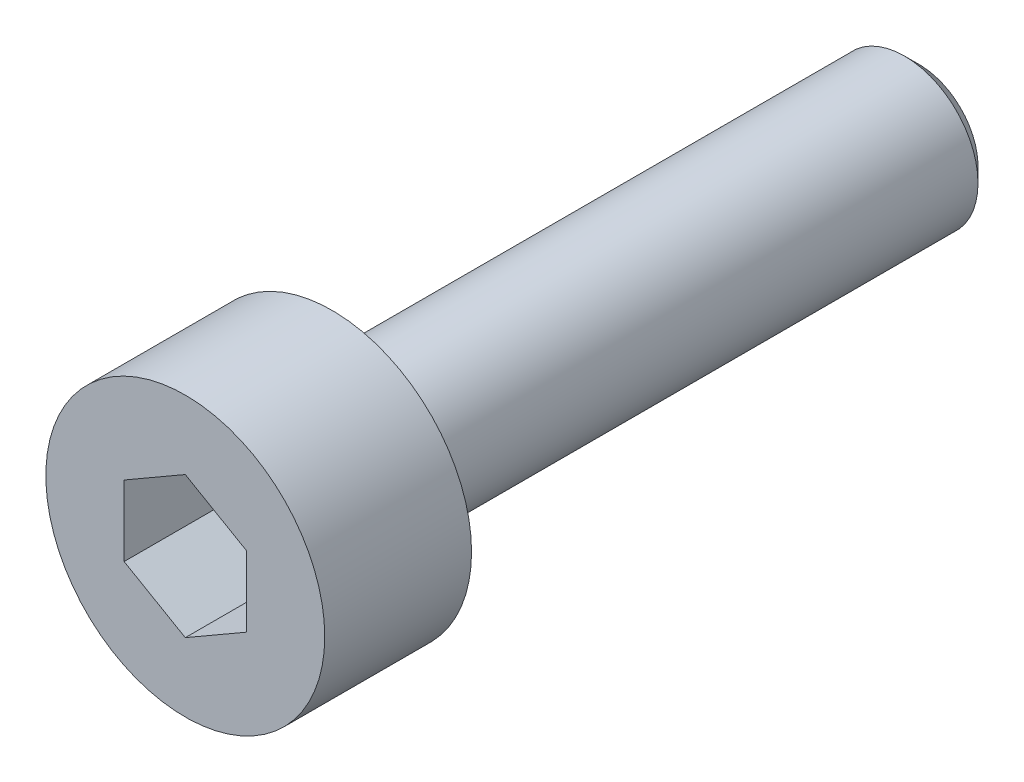
ISO-10303-21;
HEADER;
FILE_DESCRIPTION(('STEP AP214'),'2;1');
FILE_NAME('part.step','',(''),(''),'','','');
FILE_SCHEMA(('AUTOMOTIVE_DESIGN { 1 0 10303 214 1 1 1 1 }'));
ENDSEC;
DATA;
#1=APPLICATION_CONTEXT('core data for automotive mechanical design processes');
#2=APPLICATION_PROTOCOL_DEFINITION('international standard','automotive_design',2000,#1);
#3=PRODUCT_CONTEXT('',#1,'mechanical');
#4=PRODUCT('Part','Part','',(#3));
#5=PRODUCT_RELATED_PRODUCT_CATEGORY('part','',(#4));
#6=PRODUCT_DEFINITION_FORMATION('','',#4);
#7=PRODUCT_DEFINITION_CONTEXT('part definition',#1,'design');
#8=PRODUCT_DEFINITION('design','',#6,#7);
#9=PRODUCT_DEFINITION_SHAPE('','',#8);
#10=(LENGTH_UNIT() NAMED_UNIT(*) SI_UNIT(.MILLI.,.METRE.));
#11=(NAMED_UNIT(*) PLANE_ANGLE_UNIT() SI_UNIT($,.RADIAN.));
#12=(NAMED_UNIT(*) SI_UNIT($,.STERADIAN.) SOLID_ANGLE_UNIT());
#13=UNCERTAINTY_MEASURE_WITH_UNIT(LENGTH_MEASURE(1.E-05),#10,'distance_accuracy_value','');
#14=(GEOMETRIC_REPRESENTATION_CONTEXT(3) GLOBAL_UNCERTAINTY_ASSIGNED_CONTEXT((#13)) GLOBAL_UNIT_ASSIGNED_CONTEXT((#10,
#11,#12)) REPRESENTATION_CONTEXT('',''));
#15=CARTESIAN_POINT('',(0.,0.,0.));
#16=DIRECTION('',(0.,0.,1.));
#17=DIRECTION('',(1.,0.,0.));
#18=AXIS2_PLACEMENT_3D('',#15,#16,#17);
#19=CARTESIAN_POINT('',(0.,0.,0.));
#20=DIRECTION('',(0.,0.,1.));
#21=DIRECTION('',(1.,0.,0.));
#22=AXIS2_PLACEMENT_3D('',#19,#20,#21);
#23=PLANE('',#22);
#24=CARTESIAN_POINT('',(0.,0.,0.));
#25=DIRECTION('',(0.,0.,1.));
#26=DIRECTION('',(1.,0.,0.));
#27=AXIS2_PLACEMENT_3D('',#24,#25,#26);
#28=CIRCLE('',#27,2.85);
#29=CARTESIAN_POINT('',(2.85,0.,0.));
#30=VERTEX_POINT('',#29);
#31=EDGE_CURVE('E145',#30,#30,#28,.T.);
#32=ORIENTED_EDGE('',*,*,#31,.F.);
#33=EDGE_LOOP('',(#32));
#34=FACE_BOUND('',#33,.T.);
#35=CARTESIAN_POINT('',(0.,0.,0.));
#36=DIRECTION('',(0.,0.,1.));
#37=DIRECTION('',(1.,0.,0.));
#38=AXIS2_PLACEMENT_3D('',#35,#36,#37);
#39=CIRCLE('',#38,1.5);
#40=CARTESIAN_POINT('',(1.5,0.,0.));
#41=VERTEX_POINT('',#40);
#42=EDGE_CURVE('E156',#41,#41,#39,.F.);
#43=ORIENTED_EDGE('',*,*,#42,.F.);
#44=EDGE_LOOP('',(#43));
#45=FACE_BOUND('',#44,.T.);
#46=ADVANCED_FACE('F38',(#34,#45),#23,.F.);
#47=CARTESIAN_POINT('',(0.,0.,3.));
#48=DIRECTION('',(0.,0.,-1.));
#49=DIRECTION('',(-1.,0.,0.));
#50=AXIS2_PLACEMENT_3D('',#47,#48,#49);
#51=CYLINDRICAL_SURFACE('',#50,2.85);
#52=CARTESIAN_POINT('',(0.,0.,3.));
#53=DIRECTION('',(0.,0.,1.));
#54=DIRECTION('',(1.,0.,0.));
#55=AXIS2_PLACEMENT_3D('',#52,#53,#54);
#56=CIRCLE('',#55,2.85);
#57=CARTESIAN_POINT('',(2.85,0.,3.));
#58=VERTEX_POINT('',#57);
#59=EDGE_CURVE('E152',#58,#58,#56,.T.);
#60=ORIENTED_EDGE('',*,*,#59,.F.);
#61=EDGE_LOOP('',(#60));
#62=FACE_BOUND('',#61,.T.);
#63=ORIENTED_EDGE('',*,*,#31,.T.);
#64=EDGE_LOOP('',(#63));
#65=FACE_BOUND('',#64,.T.);
#66=ADVANCED_FACE('F180',(#62,#65),#51,.T.);
#67=CARTESIAN_POINT('',(0.,0.,3.));
#68=DIRECTION('',(0.,0.,1.));
#69=DIRECTION('',(1.,0.,0.));
#70=AXIS2_PLACEMENT_3D('',#67,#68,#69);
#71=PLANE('',#70);
#72=DIRECTION('',(-0.866025403784439,0.5,0.));
#73=VECTOR('',#72,1.);
#74=CARTESIAN_POINT('',(1.25,0.721687836487032,3.));
#75=LINE('',#74,#73);
#76=CARTESIAN_POINT('',(1.25,0.721687836487032,3.));
#77=VERTEX_POINT('',#76);
#78=CARTESIAN_POINT('',(0.,1.44337567297406,3.));
#79=VERTEX_POINT('',#78);
#80=EDGE_CURVE('E53',#77,#79,#75,.T.);
#81=ORIENTED_EDGE('',*,*,#80,.F.);
#82=DIRECTION('',(0.,1.,0.));
#83=VECTOR('',#82,1.);
#84=CARTESIAN_POINT('',(1.25,-0.721687836487032,3.));
#85=LINE('',#84,#83);
#86=CARTESIAN_POINT('',(1.25,-0.721687836487032,3.));
#87=VERTEX_POINT('',#86);
#88=EDGE_CURVE('E140',#87,#77,#85,.T.);
#89=ORIENTED_EDGE('',*,*,#88,.F.);
#90=DIRECTION('',(0.866025403784439,0.5,0.));
#91=VECTOR('',#90,1.);
#92=CARTESIAN_POINT('',(0.,-1.44337567297406,3.));
#93=LINE('',#92,#91);
#94=CARTESIAN_POINT('',(0.,-1.44337567297406,3.));
#95=VERTEX_POINT('',#94);
#96=EDGE_CURVE('E138',#95,#87,#93,.T.);
#97=ORIENTED_EDGE('',*,*,#96,.F.);
#98=DIRECTION('',(0.866025403784439,-0.5,0.));
#99=VECTOR('',#98,1.);
#100=CARTESIAN_POINT('',(-1.25,-0.721687836487033,3.));
#101=LINE('',#100,#99);
#102=CARTESIAN_POINT('',(-1.25,-0.721687836487033,3.));
#103=VERTEX_POINT('',#102);
#104=EDGE_CURVE('E103',#103,#95,#101,.T.);
#105=ORIENTED_EDGE('',*,*,#104,.F.);
#106=DIRECTION('',(0.,-1.,0.));
#107=VECTOR('',#106,1.);
#108=CARTESIAN_POINT('',(-1.25,0.721687836487032,3.));
#109=LINE('',#108,#107);
#110=CARTESIAN_POINT('',(-1.25,0.721687836487032,3.));
#111=VERTEX_POINT('',#110);
#112=EDGE_CURVE('E134',#111,#103,#109,.T.);
#113=ORIENTED_EDGE('',*,*,#112,.F.);
#114=DIRECTION('',(-0.866025403784439,-0.5,0.));
#115=VECTOR('',#114,1.);
#116=CARTESIAN_POINT('',(0.,1.44337567297406,3.));
#117=LINE('',#116,#115);
#118=EDGE_CURVE('E131',#79,#111,#117,.T.);
#119=ORIENTED_EDGE('',*,*,#118,.F.);
#120=EDGE_LOOP('',(#81,#89,#97,#105,#113,#119));
#121=FACE_BOUND('',#120,.T.);
#122=ORIENTED_EDGE('',*,*,#59,.T.);
#123=EDGE_LOOP('',(#122));
#124=FACE_BOUND('',#123,.T.);
#125=ADVANCED_FACE('F186',(#121,#124),#71,.T.);
#126=CARTESIAN_POINT('',(0.,0.,-12.));
#127=DIRECTION('',(0.,0.,1.));
#128=DIRECTION('',(1.,0.,0.));
#129=AXIS2_PLACEMENT_3D('',#126,#127,#128);
#130=CYLINDRICAL_SURFACE('',#129,1.5);
#131=CARTESIAN_POINT('',(0.,0.,-11.7));
#132=DIRECTION('',(0.,0.,-1.));
#133=DIRECTION('',(-1.,0.,0.));
#134=AXIS2_PLACEMENT_3D('',#131,#132,#133);
#135=CIRCLE('',#134,1.5);
#136=CARTESIAN_POINT('',(-1.5,0.,-11.7));
#137=VERTEX_POINT('',#136);
#138=EDGE_CURVE('E11',#137,#137,#135,.F.);
#139=ORIENTED_EDGE('',*,*,#138,.T.);
#140=EDGE_LOOP('',(#139));
#141=FACE_BOUND('',#140,.T.);
#142=ORIENTED_EDGE('',*,*,#42,.T.);
#143=EDGE_LOOP('',(#142));
#144=FACE_BOUND('',#143,.T.);
#145=ADVANCED_FACE('F176',(#141,#144),#130,.T.);
#146=CARTESIAN_POINT('',(0.,0.,-12.));
#147=DIRECTION('',(0.,0.,-1.));
#148=DIRECTION('',(-1.,0.,0.));
#149=AXIS2_PLACEMENT_3D('',#146,#147,#148);
#150=PLANE('',#149);
#151=CARTESIAN_POINT('',(0.,0.,-12.));
#152=DIRECTION('',(0.,0.,-1.));
#153=DIRECTION('',(-1.,0.,0.));
#154=AXIS2_PLACEMENT_3D('',#151,#152,#153);
#155=CIRCLE('',#154,1.2);
#156=CARTESIAN_POINT('',(-1.2,0.,-12.));
#157=VERTEX_POINT('',#156);
#158=EDGE_CURVE('E46',#157,#157,#155,.T.);
#159=ORIENTED_EDGE('',*,*,#158,.T.);
#160=EDGE_LOOP('',(#159));
#161=FACE_BOUND('',#160,.T.);
#162=ADVANCED_FACE('F165',(#161),#150,.T.);
#163=CARTESIAN_POINT('',(0.,0.,-12.));
#164=DIRECTION('',(0.,0.,1.));
#165=DIRECTION('',(1.,0.,0.));
#166=AXIS2_PLACEMENT_3D('',#163,#164,#165);
#167=CONICAL_SURFACE('',#166,1.2,0.785398163397444);
#168=ORIENTED_EDGE('',*,*,#138,.F.);
#169=EDGE_LOOP('',(#168));
#170=FACE_BOUND('',#169,.T.);
#171=ORIENTED_EDGE('',*,*,#158,.F.);
#172=EDGE_LOOP('',(#171));
#173=FACE_BOUND('',#172,.T.);
#174=ADVANCED_FACE('F40',(#170,#173),#167,.T.);
#175=CARTESIAN_POINT('',(1.25,0.721687836487032,1.));
#176=DIRECTION('',(0.5,0.866025403784439,0.));
#177=DIRECTION('',(-0.866025403784439,0.5,0.));
#178=AXIS2_PLACEMENT_3D('',#175,#176,#177);
#179=PLANE('',#178);
#180=ORIENTED_EDGE('',*,*,#80,.T.);
#181=DIRECTION('',(0.,0.,1.));
#182=VECTOR('',#181,1.);
#183=CARTESIAN_POINT('',(0.,1.44337567297406,1.));
#184=LINE('',#183,#182);
#185=CARTESIAN_POINT('',(0.,1.44337567297406,1.));
#186=VERTEX_POINT('',#185);
#187=EDGE_CURVE('E85',#186,#79,#184,.T.);
#188=ORIENTED_EDGE('',*,*,#187,.F.);
#189=DIRECTION('',(-0.866025403784439,0.5,0.));
#190=VECTOR('',#189,1.);
#191=CARTESIAN_POINT('',(1.25,0.721687836487032,1.));
#192=LINE('',#191,#190);
#193=CARTESIAN_POINT('',(1.25,0.721687836487032,1.));
#194=VERTEX_POINT('',#193);
#195=EDGE_CURVE('E142',#194,#186,#192,.T.);
#196=ORIENTED_EDGE('',*,*,#195,.F.);
#197=DIRECTION('',(0.,0.,1.));
#198=VECTOR('',#197,1.);
#199=CARTESIAN_POINT('',(1.25,0.721687836487032,1.));
#200=LINE('',#199,#198);
#201=EDGE_CURVE('E63',#194,#77,#200,.T.);
#202=ORIENTED_EDGE('',*,*,#201,.T.);
#203=EDGE_LOOP('',(#180,#188,#196,#202));
#204=FACE_BOUND('',#203,.T.);
#205=ADVANCED_FACE('F168',(#204),#179,.F.);
#206=CARTESIAN_POINT('',(1.25,-0.721687836487032,1.));
#207=DIRECTION('',(1.,0.,0.));
#208=DIRECTION('',(0.,1.,0.));
#209=AXIS2_PLACEMENT_3D('',#206,#207,#208);
#210=PLANE('',#209);
#211=ORIENTED_EDGE('',*,*,#88,.T.);
#212=ORIENTED_EDGE('',*,*,#201,.F.);
#213=DIRECTION('',(0.,1.,0.));
#214=VECTOR('',#213,1.);
#215=CARTESIAN_POINT('',(1.25,-0.721687836487032,1.));
#216=LINE('',#215,#214);
#217=CARTESIAN_POINT('',(1.25,-0.721687836487032,1.));
#218=VERTEX_POINT('',#217);
#219=EDGE_CURVE('E116',#218,#194,#216,.T.);
#220=ORIENTED_EDGE('',*,*,#219,.F.);
#221=DIRECTION('',(0.,0.,1.));
#222=VECTOR('',#221,1.);
#223=CARTESIAN_POINT('',(1.25,-0.721687836487032,1.));
#224=LINE('',#223,#222);
#225=EDGE_CURVE('E107',#218,#87,#224,.T.);
#226=ORIENTED_EDGE('',*,*,#225,.T.);
#227=EDGE_LOOP('',(#211,#212,#220,#226));
#228=FACE_BOUND('',#227,.T.);
#229=ADVANCED_FACE('F174',(#228),#210,.F.);
#230=CARTESIAN_POINT('',(0.,-1.44337567297406,1.));
#231=DIRECTION('',(0.5,-0.866025403784439,0.));
#232=DIRECTION('',(0.866025403784439,0.5,0.));
#233=AXIS2_PLACEMENT_3D('',#230,#231,#232);
#234=PLANE('',#233);
#235=ORIENTED_EDGE('',*,*,#96,.T.);
#236=ORIENTED_EDGE('',*,*,#225,.F.);
#237=DIRECTION('',(0.866025403784439,0.5,0.));
#238=VECTOR('',#237,1.);
#239=CARTESIAN_POINT('',(0.,-1.44337567297406,1.));
#240=LINE('',#239,#238);
#241=CARTESIAN_POINT('',(0.,-1.44337567297406,1.));
#242=VERTEX_POINT('',#241);
#243=EDGE_CURVE('E111',#242,#218,#240,.T.);
#244=ORIENTED_EDGE('',*,*,#243,.F.);
#245=DIRECTION('',(0.,0.,1.));
#246=VECTOR('',#245,1.);
#247=CARTESIAN_POINT('',(0.,-1.44337567297406,1.));
#248=LINE('',#247,#246);
#249=EDGE_CURVE('E96',#242,#95,#248,.T.);
#250=ORIENTED_EDGE('',*,*,#249,.T.);
#251=EDGE_LOOP('',(#235,#236,#244,#250));
#252=FACE_BOUND('',#251,.T.);
#253=ADVANCED_FACE('F112',(#252),#234,.F.);
#254=CARTESIAN_POINT('',(-1.25,-0.721687836487033,1.));
#255=DIRECTION('',(-0.5,-0.866025403784439,0.));
#256=DIRECTION('',(0.866025403784439,-0.5,0.));
#257=AXIS2_PLACEMENT_3D('',#254,#255,#256);
#258=PLANE('',#257);
#259=ORIENTED_EDGE('',*,*,#104,.T.);
#260=ORIENTED_EDGE('',*,*,#249,.F.);
#261=DIRECTION('',(0.866025403784439,-0.5,0.));
#262=VECTOR('',#261,1.);
#263=CARTESIAN_POINT('',(-1.25,-0.721687836487033,1.));
#264=LINE('',#263,#262);
#265=CARTESIAN_POINT('',(-1.25,-0.721687836487033,1.));
#266=VERTEX_POINT('',#265);
#267=EDGE_CURVE('E100',#266,#242,#264,.T.);
#268=ORIENTED_EDGE('',*,*,#267,.F.);
#269=DIRECTION('',(0.,0.,1.));
#270=VECTOR('',#269,1.);
#271=CARTESIAN_POINT('',(-1.25,-0.721687836487033,1.));
#272=LINE('',#271,#270);
#273=EDGE_CURVE('E108',#266,#103,#272,.T.);
#274=ORIENTED_EDGE('',*,*,#273,.T.);
#275=EDGE_LOOP('',(#259,#260,#268,#274));
#276=FACE_BOUND('',#275,.T.);
#277=ADVANCED_FACE('F98',(#276),#258,.F.);
#278=CARTESIAN_POINT('',(-1.25,0.721687836487032,1.));
#279=DIRECTION('',(-1.,0.,0.));
#280=DIRECTION('',(0.,0.,1.));
#281=AXIS2_PLACEMENT_3D('',#278,#279,#280);
#282=PLANE('',#281);
#283=ORIENTED_EDGE('',*,*,#112,.T.);
#284=ORIENTED_EDGE('',*,*,#273,.F.);
#285=DIRECTION('',(0.,-1.,0.));
#286=VECTOR('',#285,1.);
#287=CARTESIAN_POINT('',(-1.25,0.721687836487032,1.));
#288=LINE('',#287,#286);
#289=CARTESIAN_POINT('',(-1.25,0.721687836487032,1.));
#290=VERTEX_POINT('',#289);
#291=EDGE_CURVE('E122',#290,#266,#288,.T.);
#292=ORIENTED_EDGE('',*,*,#291,.F.);
#293=DIRECTION('',(0.,0.,1.));
#294=VECTOR('',#293,1.);
#295=CARTESIAN_POINT('',(-1.25,0.721687836487032,1.));
#296=LINE('',#295,#294);
#297=EDGE_CURVE('E149',#290,#111,#296,.T.);
#298=ORIENTED_EDGE('',*,*,#297,.T.);
#299=EDGE_LOOP('',(#283,#284,#292,#298));
#300=FACE_BOUND('',#299,.T.);
#301=ADVANCED_FACE('F200',(#300),#282,.F.);
#302=CARTESIAN_POINT('',(0.,1.44337567297406,1.));
#303=DIRECTION('',(-0.5,0.866025403784439,0.));
#304=DIRECTION('',(-0.866025403784439,-0.5,0.));
#305=AXIS2_PLACEMENT_3D('',#302,#303,#304);
#306=PLANE('',#305);
#307=ORIENTED_EDGE('',*,*,#118,.T.);
#308=ORIENTED_EDGE('',*,*,#297,.F.);
#309=DIRECTION('',(-0.866025403784439,-0.5,0.));
#310=VECTOR('',#309,1.);
#311=CARTESIAN_POINT('',(0.,1.44337567297406,1.));
#312=LINE('',#311,#310);
#313=EDGE_CURVE('E124',#186,#290,#312,.T.);
#314=ORIENTED_EDGE('',*,*,#313,.F.);
#315=ORIENTED_EDGE('',*,*,#187,.T.);
#316=EDGE_LOOP('',(#307,#308,#314,#315));
#317=FACE_BOUND('',#316,.T.);
#318=ADVANCED_FACE('F197',(#317),#306,.F.);
#319=CARTESIAN_POINT('',(0.,0.,1.));
#320=DIRECTION('',(0.,0.,1.));
#321=DIRECTION('',(1.,0.,0.));
#322=AXIS2_PLACEMENT_3D('',#319,#320,#321);
#323=PLANE('',#322);
#324=ORIENTED_EDGE('',*,*,#195,.T.);
#325=ORIENTED_EDGE('',*,*,#313,.T.);
#326=ORIENTED_EDGE('',*,*,#291,.T.);
#327=ORIENTED_EDGE('',*,*,#267,.T.);
#328=ORIENTED_EDGE('',*,*,#243,.T.);
#329=ORIENTED_EDGE('',*,*,#219,.T.);
#330=EDGE_LOOP('',(#324,#325,#326,#327,#328,#329));
#331=FACE_BOUND('',#330,.T.);
#332=ADVANCED_FACE('F119',(#331),#323,.T.);
#333=CLOSED_SHELL('',(#46,#66,#125,#145,#162,#174,#205,#229,#253,#277,#301,#318,#332));
#334=MANIFOLD_SOLID_BREP('B2',#333);
#335=ADVANCED_BREP_SHAPE_REPRESENTATION('',(#18,#334),#14);
#336=SHAPE_DEFINITION_REPRESENTATION(#9,#335);
ENDSEC;
END-ISO-10303-21;
